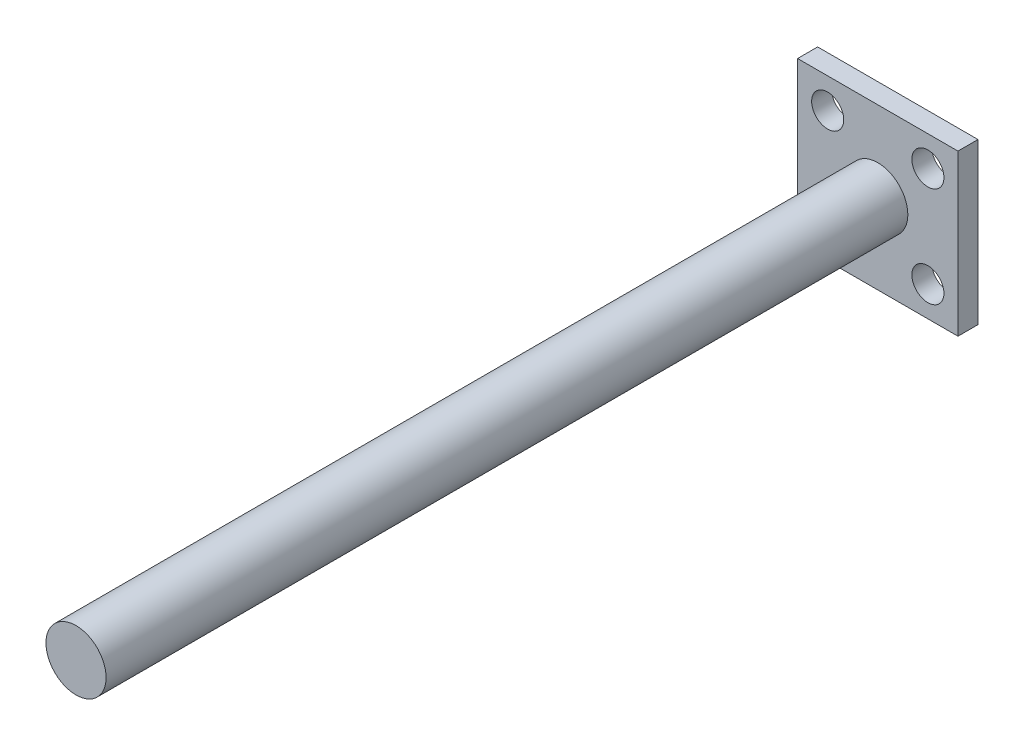
ISO-10303-21;
HEADER;
FILE_DESCRIPTION(('STEP AP214'),'2;1');
FILE_NAME('part.step','',(''),(''),'','','');
FILE_SCHEMA(('AUTOMOTIVE_DESIGN { 1 0 10303 214 1 1 1 1 }'));
ENDSEC;
DATA;
#1=APPLICATION_CONTEXT('core data for automotive mechanical design processes');
#2=APPLICATION_PROTOCOL_DEFINITION('international standard','automotive_design',2000,#1);
#3=PRODUCT_CONTEXT('',#1,'mechanical');
#4=PRODUCT('Part','Part','',(#3));
#5=PRODUCT_RELATED_PRODUCT_CATEGORY('part','',(#4));
#6=PRODUCT_DEFINITION_FORMATION('','',#4);
#7=PRODUCT_DEFINITION_CONTEXT('part definition',#1,'design');
#8=PRODUCT_DEFINITION('design','',#6,#7);
#9=PRODUCT_DEFINITION_SHAPE('','',#8);
#10=(LENGTH_UNIT() NAMED_UNIT(*) SI_UNIT(.MILLI.,.METRE.));
#11=(NAMED_UNIT(*) PLANE_ANGLE_UNIT() SI_UNIT($,.RADIAN.));
#12=(NAMED_UNIT(*) SI_UNIT($,.STERADIAN.) SOLID_ANGLE_UNIT());
#13=UNCERTAINTY_MEASURE_WITH_UNIT(LENGTH_MEASURE(1.E-05),#10,'distance_accuracy_value','');
#14=(GEOMETRIC_REPRESENTATION_CONTEXT(3) GLOBAL_UNCERTAINTY_ASSIGNED_CONTEXT((#13)) GLOBAL_UNIT_ASSIGNED_CONTEXT((#10,
#11,#12)) REPRESENTATION_CONTEXT('',''));
#15=CARTESIAN_POINT('',(0.,0.,0.));
#16=DIRECTION('',(0.,0.,1.));
#17=DIRECTION('',(1.,0.,0.));
#18=AXIS2_PLACEMENT_3D('',#15,#16,#17);
#19=CARTESIAN_POINT('',(0.,0.,5.));
#20=DIRECTION('',(0.,0.,1.));
#21=DIRECTION('',(1.,0.,0.));
#22=AXIS2_PLACEMENT_3D('',#19,#20,#21);
#23=PLANE('',#22);
#24=CARTESIAN_POINT('',(0.,0.,5.));
#25=DIRECTION('',(0.,0.,1.));
#26=DIRECTION('',(1.,0.,0.));
#27=AXIS2_PLACEMENT_3D('',#24,#25,#26);
#28=CIRCLE('',#27,7.5);
#29=CARTESIAN_POINT('',(7.5,0.,5.));
#30=VERTEX_POINT('',#29);
#31=EDGE_CURVE('E136',#30,#30,#28,.T.);
#32=ORIENTED_EDGE('',*,*,#31,.F.);
#33=EDGE_LOOP('',(#32));
#34=FACE_BOUND('',#33,.T.);
#35=CARTESIAN_POINT('',(12.5,-12.5,5.));
#36=DIRECTION('',(0.,0.,1.));
#37=DIRECTION('',(1.,0.,0.));
#38=AXIS2_PLACEMENT_3D('',#35,#36,#37);
#39=CIRCLE('',#38,4.);
#40=CARTESIAN_POINT('',(16.5,-12.5,5.));
#41=VERTEX_POINT('',#40);
#42=EDGE_CURVE('E121',#41,#41,#39,.T.);
#43=ORIENTED_EDGE('',*,*,#42,.F.);
#44=EDGE_LOOP('',(#43));
#45=FACE_BOUND('',#44,.T.);
#46=CARTESIAN_POINT('',(-12.5,12.5,5.));
#47=DIRECTION('',(0.,0.,1.));
#48=DIRECTION('',(1.,0.,0.));
#49=AXIS2_PLACEMENT_3D('',#46,#47,#48);
#50=CIRCLE('',#49,4.);
#51=CARTESIAN_POINT('',(-8.5,12.5,5.));
#52=VERTEX_POINT('',#51);
#53=EDGE_CURVE('E100',#52,#52,#50,.T.);
#54=ORIENTED_EDGE('',*,*,#53,.F.);
#55=EDGE_LOOP('',(#54));
#56=FACE_BOUND('',#55,.T.);
#57=DIRECTION('',(0.,-1.,0.));
#58=VECTOR('',#57,1.);
#59=CARTESIAN_POINT('',(-20.,-20.,5.));
#60=LINE('',#59,#58);
#61=CARTESIAN_POINT('',(-20.,20.,5.));
#62=VERTEX_POINT('',#61);
#63=CARTESIAN_POINT('',(-20.,-20.,5.));
#64=VERTEX_POINT('',#63);
#65=EDGE_CURVE('E85',#62,#64,#60,.T.);
#66=ORIENTED_EDGE('',*,*,#65,.T.);
#67=DIRECTION('',(1.,0.,0.));
#68=VECTOR('',#67,1.);
#69=CARTESIAN_POINT('',(20.,-20.,5.));
#70=LINE('',#69,#68);
#71=CARTESIAN_POINT('',(20.,-20.,5.));
#72=VERTEX_POINT('',#71);
#73=EDGE_CURVE('E80',#64,#72,#70,.T.);
#74=ORIENTED_EDGE('',*,*,#73,.T.);
#75=DIRECTION('',(0.,1.,0.));
#76=VECTOR('',#75,1.);
#77=CARTESIAN_POINT('',(20.,-20.,5.));
#78=LINE('',#77,#76);
#79=CARTESIAN_POINT('',(20.,20.,5.));
#80=VERTEX_POINT('',#79);
#81=EDGE_CURVE('E83',#72,#80,#78,.T.);
#82=ORIENTED_EDGE('',*,*,#81,.T.);
#83=DIRECTION('',(-1.,0.,0.));
#84=VECTOR('',#83,1.);
#85=CARTESIAN_POINT('',(20.,20.,5.));
#86=LINE('',#85,#84);
#87=EDGE_CURVE('E50',#80,#62,#86,.T.);
#88=ORIENTED_EDGE('',*,*,#87,.T.);
#89=EDGE_LOOP('',(#66,#74,#82,#88));
#90=FACE_BOUND('',#89,.T.);
#91=CARTESIAN_POINT('',(12.5,12.5,5.));
#92=DIRECTION('',(0.,0.,1.));
#93=DIRECTION('',(1.,0.,0.));
#94=AXIS2_PLACEMENT_3D('',#91,#92,#93);
#95=CIRCLE('',#94,4.);
#96=CARTESIAN_POINT('',(16.5,12.5,5.));
#97=VERTEX_POINT('',#96);
#98=EDGE_CURVE('E115',#97,#97,#95,.T.);
#99=ORIENTED_EDGE('',*,*,#98,.F.);
#100=EDGE_LOOP('',(#99));
#101=FACE_BOUND('',#100,.T.);
#102=CARTESIAN_POINT('',(-12.5,-12.5,5.));
#103=DIRECTION('',(0.,0.,1.));
#104=DIRECTION('',(1.,0.,0.));
#105=AXIS2_PLACEMENT_3D('',#102,#103,#104);
#106=CIRCLE('',#105,4.);
#107=CARTESIAN_POINT('',(-8.5,-12.5,5.));
#108=VERTEX_POINT('',#107);
#109=EDGE_CURVE('E127',#108,#108,#106,.T.);
#110=ORIENTED_EDGE('',*,*,#109,.F.);
#111=EDGE_LOOP('',(#110));
#112=FACE_BOUND('',#111,.T.);
#113=ADVANCED_FACE('F33',(#34,#45,#56,#90,#101,#112),#23,.T.);
#114=CARTESIAN_POINT('',(0.,0.,0.));
#115=DIRECTION('',(0.,0.,1.));
#116=DIRECTION('',(1.,0.,0.));
#117=AXIS2_PLACEMENT_3D('',#114,#115,#116);
#118=PLANE('',#117);
#119=DIRECTION('',(0.,-1.,0.));
#120=VECTOR('',#119,1.);
#121=CARTESIAN_POINT('',(-20.,-20.,0.));
#122=LINE('',#121,#120);
#123=CARTESIAN_POINT('',(-20.,20.,0.));
#124=VERTEX_POINT('',#123);
#125=CARTESIAN_POINT('',(-20.,-20.,0.));
#126=VERTEX_POINT('',#125);
#127=EDGE_CURVE('E97',#124,#126,#122,.T.);
#128=ORIENTED_EDGE('',*,*,#127,.F.);
#129=DIRECTION('',(-1.,0.,0.));
#130=VECTOR('',#129,1.);
#131=CARTESIAN_POINT('',(20.,20.,0.));
#132=LINE('',#131,#130);
#133=CARTESIAN_POINT('',(20.,20.,0.));
#134=VERTEX_POINT('',#133);
#135=EDGE_CURVE('E73',#134,#124,#132,.T.);
#136=ORIENTED_EDGE('',*,*,#135,.F.);
#137=DIRECTION('',(0.,1.,0.));
#138=VECTOR('',#137,1.);
#139=CARTESIAN_POINT('',(20.,-20.,0.));
#140=LINE('',#139,#138);
#141=CARTESIAN_POINT('',(20.,-20.,0.));
#142=VERTEX_POINT('',#141);
#143=EDGE_CURVE('E67',#142,#134,#140,.T.);
#144=ORIENTED_EDGE('',*,*,#143,.F.);
#145=DIRECTION('',(1.,0.,0.));
#146=VECTOR('',#145,1.);
#147=CARTESIAN_POINT('',(20.,-20.,0.));
#148=LINE('',#147,#146);
#149=EDGE_CURVE('E89',#126,#142,#148,.T.);
#150=ORIENTED_EDGE('',*,*,#149,.F.);
#151=EDGE_LOOP('',(#128,#136,#144,#150));
#152=FACE_BOUND('',#151,.T.);
#153=CARTESIAN_POINT('',(-12.5,12.5,0.));
#154=DIRECTION('',(0.,0.,1.));
#155=DIRECTION('',(1.,0.,0.));
#156=AXIS2_PLACEMENT_3D('',#153,#154,#155);
#157=CIRCLE('',#156,4.);
#158=CARTESIAN_POINT('',(-8.5,12.5,0.));
#159=VERTEX_POINT('',#158);
#160=EDGE_CURVE('E112',#159,#159,#157,.T.);
#161=ORIENTED_EDGE('',*,*,#160,.T.);
#162=EDGE_LOOP('',(#161));
#163=FACE_BOUND('',#162,.T.);
#164=CARTESIAN_POINT('',(12.5,12.5,0.));
#165=DIRECTION('',(0.,0.,1.));
#166=DIRECTION('',(1.,0.,0.));
#167=AXIS2_PLACEMENT_3D('',#164,#165,#166);
#168=CIRCLE('',#167,4.);
#169=CARTESIAN_POINT('',(16.5,12.5,0.));
#170=VERTEX_POINT('',#169);
#171=EDGE_CURVE('E118',#170,#170,#168,.T.);
#172=ORIENTED_EDGE('',*,*,#171,.T.);
#173=EDGE_LOOP('',(#172));
#174=FACE_BOUND('',#173,.T.);
#175=CARTESIAN_POINT('',(12.5,-12.5,0.));
#176=DIRECTION('',(0.,0.,1.));
#177=DIRECTION('',(1.,0.,0.));
#178=AXIS2_PLACEMENT_3D('',#175,#176,#177);
#179=CIRCLE('',#178,4.);
#180=CARTESIAN_POINT('',(16.5,-12.5,0.));
#181=VERTEX_POINT('',#180);
#182=EDGE_CURVE('E124',#181,#181,#179,.T.);
#183=ORIENTED_EDGE('',*,*,#182,.T.);
#184=EDGE_LOOP('',(#183));
#185=FACE_BOUND('',#184,.T.);
#186=CARTESIAN_POINT('',(-12.5,-12.5,0.));
#187=DIRECTION('',(0.,0.,1.));
#188=DIRECTION('',(1.,0.,0.));
#189=AXIS2_PLACEMENT_3D('',#186,#187,#188);
#190=CIRCLE('',#189,4.);
#191=CARTESIAN_POINT('',(-8.5,-12.5,0.));
#192=VERTEX_POINT('',#191);
#193=EDGE_CURVE('E130',#192,#192,#190,.T.);
#194=ORIENTED_EDGE('',*,*,#193,.T.);
#195=EDGE_LOOP('',(#194));
#196=FACE_BOUND('',#195,.T.);
#197=ADVANCED_FACE('F108',(#152,#163,#174,#185,#196),#118,.F.);
#198=CARTESIAN_POINT('',(-20.,-20.,5.));
#199=DIRECTION('',(1.,0.,0.));
#200=DIRECTION('',(0.,0.,-1.));
#201=AXIS2_PLACEMENT_3D('',#198,#199,#200);
#202=PLANE('',#201);
#203=ORIENTED_EDGE('',*,*,#127,.T.);
#204=DIRECTION('',(0.,0.,-1.));
#205=VECTOR('',#204,1.);
#206=CARTESIAN_POINT('',(-20.,-20.,5.));
#207=LINE('',#206,#205);
#208=EDGE_CURVE('E11',#64,#126,#207,.T.);
#209=ORIENTED_EDGE('',*,*,#208,.F.);
#210=ORIENTED_EDGE('',*,*,#65,.F.);
#211=DIRECTION('',(0.,0.,-1.));
#212=VECTOR('',#211,1.);
#213=CARTESIAN_POINT('',(-20.,20.,5.));
#214=LINE('',#213,#212);
#215=EDGE_CURVE('E93',#62,#124,#214,.T.);
#216=ORIENTED_EDGE('',*,*,#215,.T.);
#217=EDGE_LOOP('',(#203,#209,#210,#216));
#218=FACE_BOUND('',#217,.T.);
#219=ADVANCED_FACE('F35',(#218),#202,.F.);
#220=CARTESIAN_POINT('',(20.,-20.,5.));
#221=DIRECTION('',(0.,1.,0.));
#222=DIRECTION('',(-1.,0.,0.));
#223=AXIS2_PLACEMENT_3D('',#220,#221,#222);
#224=PLANE('',#223);
#225=ORIENTED_EDGE('',*,*,#149,.T.);
#226=DIRECTION('',(0.,0.,-1.));
#227=VECTOR('',#226,1.);
#228=CARTESIAN_POINT('',(20.,-20.,5.));
#229=LINE('',#228,#227);
#230=EDGE_CURVE('E42',#72,#142,#229,.T.);
#231=ORIENTED_EDGE('',*,*,#230,.F.);
#232=ORIENTED_EDGE('',*,*,#73,.F.);
#233=ORIENTED_EDGE('',*,*,#208,.T.);
#234=EDGE_LOOP('',(#225,#231,#232,#233));
#235=FACE_BOUND('',#234,.T.);
#236=ADVANCED_FACE('F88',(#235),#224,.F.);
#237=CARTESIAN_POINT('',(20.,-20.,5.));
#238=DIRECTION('',(-1.,0.,0.));
#239=DIRECTION('',(0.,0.,1.));
#240=AXIS2_PLACEMENT_3D('',#237,#238,#239);
#241=PLANE('',#240);
#242=ORIENTED_EDGE('',*,*,#143,.T.);
#243=DIRECTION('',(0.,0.,-1.));
#244=VECTOR('',#243,1.);
#245=CARTESIAN_POINT('',(20.,20.,5.));
#246=LINE('',#245,#244);
#247=EDGE_CURVE('E90',#80,#134,#246,.T.);
#248=ORIENTED_EDGE('',*,*,#247,.F.);
#249=ORIENTED_EDGE('',*,*,#81,.F.);
#250=ORIENTED_EDGE('',*,*,#230,.T.);
#251=EDGE_LOOP('',(#242,#248,#249,#250));
#252=FACE_BOUND('',#251,.T.);
#253=ADVANCED_FACE('F91',(#252),#241,.F.);
#254=CARTESIAN_POINT('',(20.,20.,5.));
#255=DIRECTION('',(0.,-1.,0.));
#256=DIRECTION('',(1.,0.,0.));
#257=AXIS2_PLACEMENT_3D('',#254,#255,#256);
#258=PLANE('',#257);
#259=ORIENTED_EDGE('',*,*,#135,.T.);
#260=ORIENTED_EDGE('',*,*,#215,.F.);
#261=ORIENTED_EDGE('',*,*,#87,.F.);
#262=ORIENTED_EDGE('',*,*,#247,.T.);
#263=EDGE_LOOP('',(#259,#260,#261,#262));
#264=FACE_BOUND('',#263,.T.);
#265=ADVANCED_FACE('F105',(#264),#258,.F.);
#266=CARTESIAN_POINT('',(-12.5,12.5,5.));
#267=DIRECTION('',(0.,0.,-1.));
#268=DIRECTION('',(-1.,0.,0.));
#269=AXIS2_PLACEMENT_3D('',#266,#267,#268);
#270=CYLINDRICAL_SURFACE('',#269,4.);
#271=ORIENTED_EDGE('',*,*,#53,.T.);
#272=EDGE_LOOP('',(#271));
#273=FACE_BOUND('',#272,.T.);
#274=ORIENTED_EDGE('',*,*,#160,.F.);
#275=EDGE_LOOP('',(#274));
#276=FACE_BOUND('',#275,.T.);
#277=ADVANCED_FACE('F158',(#273,#276),#270,.F.);
#278=CARTESIAN_POINT('',(12.5,12.5,5.));
#279=DIRECTION('',(0.,0.,-1.));
#280=DIRECTION('',(-1.,0.,0.));
#281=AXIS2_PLACEMENT_3D('',#278,#279,#280);
#282=CYLINDRICAL_SURFACE('',#281,4.);
#283=ORIENTED_EDGE('',*,*,#98,.T.);
#284=EDGE_LOOP('',(#283));
#285=FACE_BOUND('',#284,.T.);
#286=ORIENTED_EDGE('',*,*,#171,.F.);
#287=EDGE_LOOP('',(#286));
#288=FACE_BOUND('',#287,.T.);
#289=ADVANCED_FACE('F161',(#285,#288),#282,.F.);
#290=CARTESIAN_POINT('',(12.5,-12.5,5.));
#291=DIRECTION('',(0.,0.,-1.));
#292=DIRECTION('',(-1.,0.,0.));
#293=AXIS2_PLACEMENT_3D('',#290,#291,#292);
#294=CYLINDRICAL_SURFACE('',#293,4.);
#295=ORIENTED_EDGE('',*,*,#42,.T.);
#296=EDGE_LOOP('',(#295));
#297=FACE_BOUND('',#296,.T.);
#298=ORIENTED_EDGE('',*,*,#182,.F.);
#299=EDGE_LOOP('',(#298));
#300=FACE_BOUND('',#299,.T.);
#301=ADVANCED_FACE('F174',(#297,#300),#294,.F.);
#302=CARTESIAN_POINT('',(-12.5,-12.5,5.));
#303=DIRECTION('',(0.,0.,-1.));
#304=DIRECTION('',(-1.,0.,0.));
#305=AXIS2_PLACEMENT_3D('',#302,#303,#304);
#306=CYLINDRICAL_SURFACE('',#305,4.);
#307=ORIENTED_EDGE('',*,*,#109,.T.);
#308=EDGE_LOOP('',(#307));
#309=FACE_BOUND('',#308,.T.);
#310=ORIENTED_EDGE('',*,*,#193,.F.);
#311=EDGE_LOOP('',(#310));
#312=FACE_BOUND('',#311,.T.);
#313=ADVANCED_FACE('F147',(#309,#312),#306,.F.);
#314=CARTESIAN_POINT('',(0.,0.,205.));
#315=DIRECTION('',(0.,0.,-1.));
#316=DIRECTION('',(-1.,0.,0.));
#317=AXIS2_PLACEMENT_3D('',#314,#315,#316);
#318=CYLINDRICAL_SURFACE('',#317,7.5);
#319=CARTESIAN_POINT('',(0.,0.,205.));
#320=DIRECTION('',(0.,0.,1.));
#321=DIRECTION('',(1.,0.,0.));
#322=AXIS2_PLACEMENT_3D('',#319,#320,#321);
#323=CIRCLE('',#322,7.5);
#324=CARTESIAN_POINT('',(7.5,0.,205.));
#325=VERTEX_POINT('',#324);
#326=EDGE_CURVE('E133',#325,#325,#323,.T.);
#327=ORIENTED_EDGE('',*,*,#326,.F.);
#328=EDGE_LOOP('',(#327));
#329=FACE_BOUND('',#328,.T.);
#330=ORIENTED_EDGE('',*,*,#31,.T.);
#331=EDGE_LOOP('',(#330));
#332=FACE_BOUND('',#331,.T.);
#333=ADVANCED_FACE('F144',(#329,#332),#318,.T.);
#334=CARTESIAN_POINT('',(0.,0.,205.));
#335=DIRECTION('',(0.,0.,1.));
#336=DIRECTION('',(1.,0.,0.));
#337=AXIS2_PLACEMENT_3D('',#334,#335,#336);
#338=PLANE('',#337);
#339=ORIENTED_EDGE('',*,*,#326,.T.);
#340=EDGE_LOOP('',(#339));
#341=FACE_BOUND('',#340,.T.);
#342=ADVANCED_FACE('F142',(#341),#338,.T.);
#343=CLOSED_SHELL('',(#113,#197,#219,#236,#253,#265,#277,#289,#301,#313,#333,#342));
#344=MANIFOLD_SOLID_BREP('B2',#343);
#345=ADVANCED_BREP_SHAPE_REPRESENTATION('',(#18,#344),#14);
#346=SHAPE_DEFINITION_REPRESENTATION(#9,#345);
ENDSEC;
END-ISO-10303-21;
